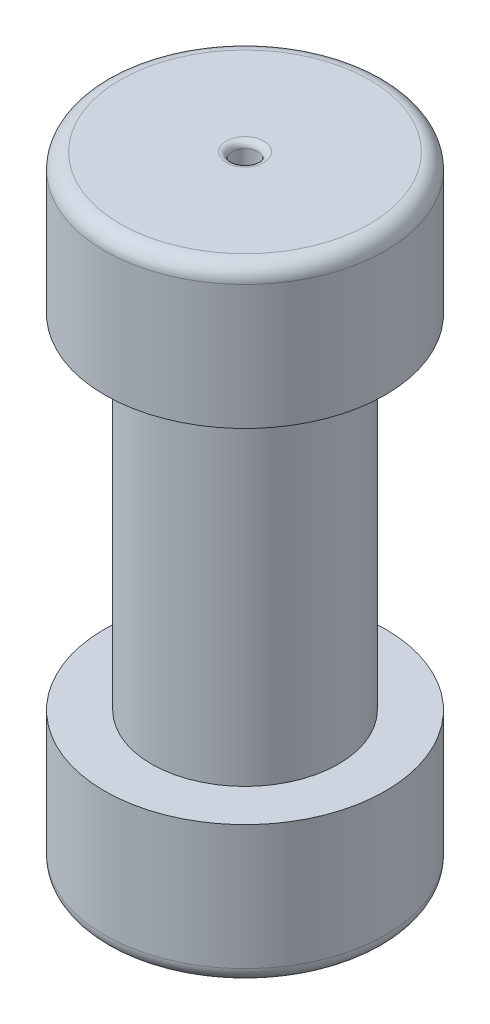
ISO-10303-21;
HEADER;
FILE_DESCRIPTION(('STEP AP214'),'2;1');
FILE_NAME('part.step','',(''),(''),'','','');
FILE_SCHEMA(('AUTOMOTIVE_DESIGN { 1 0 10303 214 1 1 1 1 }'));
ENDSEC;
DATA;
#1=APPLICATION_CONTEXT('core data for automotive mechanical design processes');
#2=APPLICATION_PROTOCOL_DEFINITION('international standard','automotive_design',2000,#1);
#3=PRODUCT_CONTEXT('',#1,'mechanical');
#4=PRODUCT('Part','Part','',(#3));
#5=PRODUCT_RELATED_PRODUCT_CATEGORY('part','',(#4));
#6=PRODUCT_DEFINITION_FORMATION('','',#4);
#7=PRODUCT_DEFINITION_CONTEXT('part definition',#1,'design');
#8=PRODUCT_DEFINITION('design','',#6,#7);
#9=PRODUCT_DEFINITION_SHAPE('','',#8);
#10=(LENGTH_UNIT() NAMED_UNIT(*) SI_UNIT(.MILLI.,.METRE.));
#11=(NAMED_UNIT(*) PLANE_ANGLE_UNIT() SI_UNIT($,.RADIAN.));
#12=(NAMED_UNIT(*) SI_UNIT($,.STERADIAN.) SOLID_ANGLE_UNIT());
#13=UNCERTAINTY_MEASURE_WITH_UNIT(LENGTH_MEASURE(1.E-05),#10,'distance_accuracy_value','');
#14=(GEOMETRIC_REPRESENTATION_CONTEXT(3) GLOBAL_UNCERTAINTY_ASSIGNED_CONTEXT((#13)) GLOBAL_UNIT_ASSIGNED_CONTEXT((#10,
#11,#12)) REPRESENTATION_CONTEXT('',''));
#15=CARTESIAN_POINT('',(0.,0.,0.));
#16=DIRECTION('',(0.,0.,1.));
#17=DIRECTION('',(1.,0.,0.));
#18=AXIS2_PLACEMENT_3D('',#15,#16,#17);
#19=CARTESIAN_POINT('',(0.,22.86,0.));
#20=DIRECTION('',(0.,-1.,0.));
#21=DIRECTION('',(0.,0.,-1.));
#22=AXIS2_PLACEMENT_3D('',#19,#20,#21);
#23=CYLINDRICAL_SURFACE('',#22,22.86);
#24=CARTESIAN_POINT('',(0.,2.54,0.));
#25=DIRECTION('',(0.,1.,0.));
#26=DIRECTION('',(0.,0.,1.));
#27=AXIS2_PLACEMENT_3D('',#24,#25,#26);
#28=CIRCLE('',#27,22.86);
#29=CARTESIAN_POINT('',(0.,2.54,22.86));
#30=VERTEX_POINT('',#29);
#31=EDGE_CURVE('E144',#30,#30,#28,.T.);
#32=ORIENTED_EDGE('',*,*,#31,.T.);
#33=EDGE_LOOP('',(#32));
#34=FACE_BOUND('',#33,.T.);
#35=CARTESIAN_POINT('',(0.,22.86,0.));
#36=DIRECTION('',(0.,1.,0.));
#37=DIRECTION('',(0.,0.,1.));
#38=AXIS2_PLACEMENT_3D('',#35,#36,#37);
#39=CIRCLE('',#38,22.86);
#40=CARTESIAN_POINT('',(0.,22.86,22.86));
#41=VERTEX_POINT('',#40);
#42=EDGE_CURVE('E140',#41,#41,#39,.T.);
#43=ORIENTED_EDGE('',*,*,#42,.F.);
#44=EDGE_LOOP('',(#43));
#45=FACE_BOUND('',#44,.T.);
#46=ADVANCED_FACE('F42',(#34,#45),#23,.T.);
#47=CARTESIAN_POINT('',(0.,22.86,0.));
#48=DIRECTION('',(0.,1.,0.));
#49=DIRECTION('',(0.,0.,1.));
#50=AXIS2_PLACEMENT_3D('',#47,#48,#49);
#51=PLANE('',#50);
#52=CARTESIAN_POINT('',(0.,22.86,0.));
#53=DIRECTION('',(0.,1.,0.));
#54=DIRECTION('',(0.,0.,1.));
#55=AXIS2_PLACEMENT_3D('',#52,#53,#54);
#56=CIRCLE('',#55,15.24);
#57=CARTESIAN_POINT('',(0.,22.86,15.24));
#58=VERTEX_POINT('',#57);
#59=EDGE_CURVE('E141',#58,#58,#56,.T.);
#60=ORIENTED_EDGE('',*,*,#59,.F.);
#61=EDGE_LOOP('',(#60));
#62=FACE_BOUND('',#61,.T.);
#63=ORIENTED_EDGE('',*,*,#42,.T.);
#64=EDGE_LOOP('',(#63));
#65=FACE_BOUND('',#64,.T.);
#66=ADVANCED_FACE('F204',(#62,#65),#51,.T.);
#67=CARTESIAN_POINT('',(0.,0.,0.));
#68=DIRECTION('',(0.,1.,0.));
#69=DIRECTION('',(0.,0.,1.));
#70=AXIS2_PLACEMENT_3D('',#67,#68,#69);
#71=PLANE('',#70);
#72=DIRECTION('',(1.,0.,0.));
#73=VECTOR('',#72,1.);
#74=CARTESIAN_POINT('',(0.,0.,-2.7));
#75=LINE('',#74,#73);
#76=CARTESIAN_POINT('',(2.85,0.,-2.7));
#77=VERTEX_POINT('',#76);
#78=CARTESIAN_POINT('',(-2.85,0.,-2.7));
#79=VERTEX_POINT('',#78);
#80=EDGE_CURVE('E163',#77,#79,#75,.F.);
#81=ORIENTED_EDGE('',*,*,#80,.T.);
#82=DIRECTION('',(0.,0.,-1.));
#83=VECTOR('',#82,1.);
#84=CARTESIAN_POINT('',(-2.85,0.,0.));
#85=LINE('',#84,#83);
#86=CARTESIAN_POINT('',(-2.85,0.,2.7));
#87=VERTEX_POINT('',#86);
#88=EDGE_CURVE('E165',#79,#87,#85,.F.);
#89=ORIENTED_EDGE('',*,*,#88,.T.);
#90=DIRECTION('',(-1.,0.,0.));
#91=VECTOR('',#90,1.);
#92=CARTESIAN_POINT('',(0.,0.,2.7));
#93=LINE('',#92,#91);
#94=CARTESIAN_POINT('',(2.85,0.,2.7));
#95=VERTEX_POINT('',#94);
#96=EDGE_CURVE('E159',#87,#95,#93,.F.);
#97=ORIENTED_EDGE('',*,*,#96,.T.);
#98=DIRECTION('',(0.,0.,1.));
#99=VECTOR('',#98,1.);
#100=CARTESIAN_POINT('',(2.85,0.,0.));
#101=LINE('',#100,#99);
#102=EDGE_CURVE('E161',#95,#77,#101,.F.);
#103=ORIENTED_EDGE('',*,*,#102,.T.);
#104=EDGE_LOOP('',(#81,#89,#97,#103));
#105=FACE_BOUND('',#104,.T.);
#106=CARTESIAN_POINT('',(0.,0.,0.));
#107=DIRECTION('',(0.,1.,0.));
#108=DIRECTION('',(0.,0.,1.));
#109=AXIS2_PLACEMENT_3D('',#106,#107,#108);
#110=CIRCLE('',#109,20.32);
#111=CARTESIAN_POINT('',(0.,0.,20.32));
#112=VERTEX_POINT('',#111);
#113=EDGE_CURVE('E149',#112,#112,#110,.F.);
#114=ORIENTED_EDGE('',*,*,#113,.T.);
#115=EDGE_LOOP('',(#114));
#116=FACE_BOUND('',#115,.T.);
#117=ADVANCED_FACE('F212',(#105,#116),#71,.F.);
#118=CARTESIAN_POINT('',(0.,78.74,0.));
#119=DIRECTION('',(0.,-1.,0.));
#120=DIRECTION('',(0.,0.,-1.));
#121=AXIS2_PLACEMENT_3D('',#118,#119,#120);
#122=CYLINDRICAL_SURFACE('',#121,15.24);
#123=CARTESIAN_POINT('',(0.,78.74,0.));
#124=DIRECTION('',(0.,1.,0.));
#125=DIRECTION('',(0.,0.,1.));
#126=AXIS2_PLACEMENT_3D('',#123,#124,#125);
#127=CIRCLE('',#126,15.24);
#128=CARTESIAN_POINT('',(0.,78.74,15.24));
#129=VERTEX_POINT('',#128);
#130=EDGE_CURVE('E137',#129,#129,#127,.T.);
#131=ORIENTED_EDGE('',*,*,#130,.F.);
#132=EDGE_LOOP('',(#131));
#133=FACE_BOUND('',#132,.T.);
#134=ORIENTED_EDGE('',*,*,#59,.T.);
#135=EDGE_LOOP('',(#134));
#136=FACE_BOUND('',#135,.T.);
#137=ADVANCED_FACE('F254',(#133,#136),#122,.T.);
#138=CARTESIAN_POINT('',(0.,101.6,0.));
#139=DIRECTION('',(0.,-1.,0.));
#140=DIRECTION('',(0.,0.,-1.));
#141=AXIS2_PLACEMENT_3D('',#138,#139,#140);
#142=CYLINDRICAL_SURFACE('',#141,22.86);
#143=CARTESIAN_POINT('',(0.,99.06,0.));
#144=DIRECTION('',(0.,1.,0.));
#145=DIRECTION('',(0.,0.,1.));
#146=AXIS2_PLACEMENT_3D('',#143,#144,#145);
#147=CIRCLE('',#146,22.86);
#148=CARTESIAN_POINT('',(0.,99.06,22.86));
#149=VERTEX_POINT('',#148);
#150=EDGE_CURVE('E155',#149,#149,#147,.F.);
#151=ORIENTED_EDGE('',*,*,#150,.T.);
#152=EDGE_LOOP('',(#151));
#153=FACE_BOUND('',#152,.T.);
#154=CARTESIAN_POINT('',(0.,78.74,0.));
#155=DIRECTION('',(0.,1.,0.));
#156=DIRECTION('',(0.,0.,1.));
#157=AXIS2_PLACEMENT_3D('',#154,#155,#156);
#158=CIRCLE('',#157,22.86);
#159=CARTESIAN_POINT('',(0.,78.74,22.86));
#160=VERTEX_POINT('',#159);
#161=EDGE_CURVE('E134',#160,#160,#158,.T.);
#162=ORIENTED_EDGE('',*,*,#161,.T.);
#163=EDGE_LOOP('',(#162));
#164=FACE_BOUND('',#163,.T.);
#165=ADVANCED_FACE('F265',(#153,#164),#142,.T.);
#166=CARTESIAN_POINT('',(0.,101.6,0.));
#167=DIRECTION('',(0.,1.,0.));
#168=DIRECTION('',(0.,0.,1.));
#169=AXIS2_PLACEMENT_3D('',#166,#167,#168);
#170=PLANE('',#169);
#171=CARTESIAN_POINT('',(0.,101.6,0.));
#172=DIRECTION('',(0.,1.,0.));
#173=DIRECTION('',(0.,0.,1.));
#174=AXIS2_PLACEMENT_3D('',#171,#172,#173);
#175=CIRCLE('',#174,3.055);
#176=CARTESIAN_POINT('',(0.,101.6,3.055));
#177=VERTEX_POINT('',#176);
#178=EDGE_CURVE('E11',#177,#177,#175,.F.);
#179=ORIENTED_EDGE('',*,*,#178,.T.);
#180=EDGE_LOOP('',(#179));
#181=FACE_BOUND('',#180,.T.);
#182=CARTESIAN_POINT('',(0.,101.6,0.));
#183=DIRECTION('',(0.,1.,0.));
#184=DIRECTION('',(0.,0.,1.));
#185=AXIS2_PLACEMENT_3D('',#182,#183,#184);
#186=CIRCLE('',#185,20.32);
#187=CARTESIAN_POINT('',(0.,101.6,20.32));
#188=VERTEX_POINT('',#187);
#189=EDGE_CURVE('E152',#188,#188,#186,.T.);
#190=ORIENTED_EDGE('',*,*,#189,.T.);
#191=EDGE_LOOP('',(#190));
#192=FACE_BOUND('',#191,.T.);
#193=ADVANCED_FACE('F261',(#181,#192),#170,.T.);
#194=CARTESIAN_POINT('',(0.,78.74,0.));
#195=DIRECTION('',(0.,1.,0.));
#196=DIRECTION('',(0.,0.,1.));
#197=AXIS2_PLACEMENT_3D('',#194,#195,#196);
#198=PLANE('',#197);
#199=ORIENTED_EDGE('',*,*,#130,.T.);
#200=EDGE_LOOP('',(#199));
#201=FACE_BOUND('',#200,.T.);
#202=ORIENTED_EDGE('',*,*,#161,.F.);
#203=EDGE_LOOP('',(#202));
#204=FACE_BOUND('',#203,.T.);
#205=ADVANCED_FACE('F222',(#201,#204),#198,.F.);
#206=CARTESIAN_POINT('',(0.,2.54,0.));
#207=DIRECTION('',(0.,1.,0.));
#208=DIRECTION('',(0.,0.,1.));
#209=AXIS2_PLACEMENT_3D('',#206,#207,#208);
#210=TOROIDAL_SURFACE('',#209,20.32,2.54);
#211=ORIENTED_EDGE('',*,*,#113,.F.);
#212=EDGE_LOOP('',(#211));
#213=FACE_BOUND('',#212,.T.);
#214=ORIENTED_EDGE('',*,*,#31,.F.);
#215=EDGE_LOOP('',(#214));
#216=FACE_BOUND('',#215,.T.);
#217=ADVANCED_FACE('F218',(#213,#216),#210,.T.);
#218=CARTESIAN_POINT('',(0.,99.06,0.));
#219=DIRECTION('',(0.,1.,0.));
#220=DIRECTION('',(0.,0.,1.));
#221=AXIS2_PLACEMENT_3D('',#218,#219,#220);
#222=TOROIDAL_SURFACE('',#221,20.32,2.54);
#223=ORIENTED_EDGE('',*,*,#150,.F.);
#224=EDGE_LOOP('',(#223));
#225=FACE_BOUND('',#224,.T.);
#226=ORIENTED_EDGE('',*,*,#189,.F.);
#227=EDGE_LOOP('',(#226));
#228=FACE_BOUND('',#227,.T.);
#229=ADVANCED_FACE('F221',(#225,#228),#222,.T.);
#230=CARTESIAN_POINT('',(0.,93.98,0.));
#231=DIRECTION('',(0.,1.,0.));
#232=DIRECTION('',(0.,0.,1.));
#233=AXIS2_PLACEMENT_3D('',#230,#231,#232);
#234=CYLINDRICAL_SURFACE('',#233,2.055);
#235=CARTESIAN_POINT('',(0.,100.6,0.));
#236=DIRECTION('',(0.,1.,0.));
#237=DIRECTION('',(0.,0.,1.));
#238=AXIS2_PLACEMENT_3D('',#235,#236,#237);
#239=CIRCLE('',#238,2.055);
#240=CARTESIAN_POINT('',(0.,100.6,2.055));
#241=VERTEX_POINT('',#240);
#242=EDGE_CURVE('E51',#241,#241,#239,.T.);
#243=ORIENTED_EDGE('',*,*,#242,.T.);
#244=EDGE_LOOP('',(#243));
#245=FACE_BOUND('',#244,.T.);
#246=CARTESIAN_POINT('',(0.,93.98,0.));
#247=DIRECTION('',(0.,1.,0.));
#248=DIRECTION('',(0.,0.,1.));
#249=AXIS2_PLACEMENT_3D('',#246,#247,#248);
#250=CIRCLE('',#249,2.055);
#251=CARTESIAN_POINT('',(0.,93.98,2.055));
#252=VERTEX_POINT('',#251);
#253=EDGE_CURVE('E128',#252,#252,#250,.T.);
#254=ORIENTED_EDGE('',*,*,#253,.F.);
#255=EDGE_LOOP('',(#254));
#256=FACE_BOUND('',#255,.T.);
#257=ADVANCED_FACE('F226',(#245,#256),#234,.F.);
#258=CARTESIAN_POINT('',(0.,93.98,0.));
#259=DIRECTION('',(0.,1.,0.));
#260=DIRECTION('',(0.,0.,1.));
#261=AXIS2_PLACEMENT_3D('',#258,#259,#260);
#262=PLANE('',#261);
#263=ORIENTED_EDGE('',*,*,#253,.T.);
#264=EDGE_LOOP('',(#263));
#265=FACE_BOUND('',#264,.T.);
#266=ADVANCED_FACE('F248',(#265),#262,.T.);
#267=CARTESIAN_POINT('',(-1.85,85.,1.7));
#268=DIRECTION('',(-1.,0.,0.));
#269=DIRECTION('',(0.,0.,1.));
#270=AXIS2_PLACEMENT_3D('',#267,#268,#269);
#271=PLANE('',#270);
#272=DIRECTION('',(0.,-1.,0.));
#273=VECTOR('',#272,1.);
#274=CARTESIAN_POINT('',(-1.85,85.,1.7));
#275=LINE('',#274,#273);
#276=CARTESIAN_POINT('',(-1.85,85.,1.7));
#277=VERTEX_POINT('',#276);
#278=CARTESIAN_POINT('',(-1.85,1.,1.7));
#279=VERTEX_POINT('',#278);
#280=EDGE_CURVE('E126',#277,#279,#275,.T.);
#281=ORIENTED_EDGE('',*,*,#280,.T.);
#282=DIRECTION('',(0.,0.,-1.));
#283=VECTOR('',#282,1.);
#284=CARTESIAN_POINT('',(-1.85,1.,1.7));
#285=LINE('',#284,#283);
#286=CARTESIAN_POINT('',(-1.85,1.,-1.7));
#287=VERTEX_POINT('',#286);
#288=EDGE_CURVE('E106',#279,#287,#285,.T.);
#289=ORIENTED_EDGE('',*,*,#288,.T.);
#290=DIRECTION('',(0.,-1.,0.));
#291=VECTOR('',#290,1.);
#292=CARTESIAN_POINT('',(-1.85,85.,-1.7));
#293=LINE('',#292,#291);
#294=CARTESIAN_POINT('',(-1.85,85.,-1.7));
#295=VERTEX_POINT('',#294);
#296=EDGE_CURVE('E98',#295,#287,#293,.T.);
#297=ORIENTED_EDGE('',*,*,#296,.F.);
#298=DIRECTION('',(0.,0.,-1.));
#299=VECTOR('',#298,1.);
#300=CARTESIAN_POINT('',(-1.85,85.,1.7));
#301=LINE('',#300,#299);
#302=EDGE_CURVE('E103',#277,#295,#301,.T.);
#303=ORIENTED_EDGE('',*,*,#302,.F.);
#304=EDGE_LOOP('',(#281,#289,#297,#303));
#305=FACE_BOUND('',#304,.T.);
#306=ADVANCED_FACE('F101',(#305),#271,.F.);
#307=CARTESIAN_POINT('',(-1.85,85.,1.7));
#308=DIRECTION('',(0.,0.,1.));
#309=DIRECTION('',(1.,0.,0.));
#310=AXIS2_PLACEMENT_3D('',#307,#308,#309);
#311=PLANE('',#310);
#312=DIRECTION('',(0.,-1.,0.));
#313=VECTOR('',#312,1.);
#314=CARTESIAN_POINT('',(1.85,85.,1.7));
#315=LINE('',#314,#313);
#316=CARTESIAN_POINT('',(1.85,85.,1.7));
#317=VERTEX_POINT('',#316);
#318=CARTESIAN_POINT('',(1.85,1.,1.7));
#319=VERTEX_POINT('',#318);
#320=EDGE_CURVE('E129',#317,#319,#315,.T.);
#321=ORIENTED_EDGE('',*,*,#320,.T.);
#322=DIRECTION('',(-1.,0.,0.));
#323=VECTOR('',#322,1.);
#324=CARTESIAN_POINT('',(-1.85,1.,1.7));
#325=LINE('',#324,#323);
#326=EDGE_CURVE('E170',#319,#279,#325,.T.);
#327=ORIENTED_EDGE('',*,*,#326,.T.);
#328=ORIENTED_EDGE('',*,*,#280,.F.);
#329=DIRECTION('',(-1.,0.,0.));
#330=VECTOR('',#329,1.);
#331=CARTESIAN_POINT('',(-1.85,85.,1.7));
#332=LINE('',#331,#330);
#333=EDGE_CURVE('E108',#317,#277,#332,.T.);
#334=ORIENTED_EDGE('',*,*,#333,.F.);
#335=EDGE_LOOP('',(#321,#327,#328,#334));
#336=FACE_BOUND('',#335,.T.);
#337=ADVANCED_FACE('F193',(#336),#311,.F.);
#338=CARTESIAN_POINT('',(1.85,85.,1.7));
#339=DIRECTION('',(1.,0.,0.));
#340=DIRECTION('',(0.,0.,-1.));
#341=AXIS2_PLACEMENT_3D('',#338,#339,#340);
#342=PLANE('',#341);
#343=DIRECTION('',(0.,-1.,0.));
#344=VECTOR('',#343,1.);
#345=CARTESIAN_POINT('',(1.85,85.,-1.7));
#346=LINE('',#345,#344);
#347=CARTESIAN_POINT('',(1.85,85.,-1.7));
#348=VERTEX_POINT('',#347);
#349=CARTESIAN_POINT('',(1.85,1.,-1.7));
#350=VERTEX_POINT('',#349);
#351=EDGE_CURVE('E107',#348,#350,#346,.T.);
#352=ORIENTED_EDGE('',*,*,#351,.T.);
#353=DIRECTION('',(0.,0.,1.));
#354=VECTOR('',#353,1.);
#355=CARTESIAN_POINT('',(1.85,1.,1.7));
#356=LINE('',#355,#354);
#357=EDGE_CURVE('E59',#350,#319,#356,.T.);
#358=ORIENTED_EDGE('',*,*,#357,.T.);
#359=ORIENTED_EDGE('',*,*,#320,.F.);
#360=DIRECTION('',(0.,0.,1.));
#361=VECTOR('',#360,1.);
#362=CARTESIAN_POINT('',(1.85,85.,1.7));
#363=LINE('',#362,#361);
#364=EDGE_CURVE('E116',#348,#317,#363,.T.);
#365=ORIENTED_EDGE('',*,*,#364,.F.);
#366=EDGE_LOOP('',(#352,#358,#359,#365));
#367=FACE_BOUND('',#366,.T.);
#368=ADVANCED_FACE('F194',(#367),#342,.F.);
#369=CARTESIAN_POINT('',(-1.85,85.,-1.7));
#370=DIRECTION('',(0.,0.,-1.));
#371=DIRECTION('',(-1.,0.,0.));
#372=AXIS2_PLACEMENT_3D('',#369,#370,#371);
#373=PLANE('',#372);
#374=ORIENTED_EDGE('',*,*,#296,.T.);
#375=DIRECTION('',(1.,0.,0.));
#376=VECTOR('',#375,1.);
#377=CARTESIAN_POINT('',(-1.85,1.,-1.7));
#378=LINE('',#377,#376);
#379=EDGE_CURVE('E67',#287,#350,#378,.T.);
#380=ORIENTED_EDGE('',*,*,#379,.T.);
#381=ORIENTED_EDGE('',*,*,#351,.F.);
#382=DIRECTION('',(1.,0.,0.));
#383=VECTOR('',#382,1.);
#384=CARTESIAN_POINT('',(-1.85,85.,-1.7));
#385=LINE('',#384,#383);
#386=EDGE_CURVE('E111',#295,#348,#385,.T.);
#387=ORIENTED_EDGE('',*,*,#386,.F.);
#388=EDGE_LOOP('',(#374,#380,#381,#387));
#389=FACE_BOUND('',#388,.T.);
#390=ADVANCED_FACE('F112',(#389),#373,.F.);
#391=CARTESIAN_POINT('',(0.,85.,0.));
#392=DIRECTION('',(0.,-1.,0.));
#393=DIRECTION('',(0.,0.,-1.));
#394=AXIS2_PLACEMENT_3D('',#391,#392,#393);
#395=PLANE('',#394);
#396=ORIENTED_EDGE('',*,*,#302,.T.);
#397=ORIENTED_EDGE('',*,*,#386,.T.);
#398=ORIENTED_EDGE('',*,*,#364,.T.);
#399=ORIENTED_EDGE('',*,*,#333,.T.);
#400=EDGE_LOOP('',(#396,#397,#398,#399));
#401=FACE_BOUND('',#400,.T.);
#402=ADVANCED_FACE('F118',(#401),#395,.T.);
#403=CARTESIAN_POINT('',(2.85,1.,1.7));
#404=DIRECTION('',(0.,0.,1.));
#405=DIRECTION('',(1.,0.,0.));
#406=AXIS2_PLACEMENT_3D('',#403,#404,#405);
#407=CYLINDRICAL_SURFACE('',#406,1.);
#408=CARTESIAN_POINT('',(2.85,1.,-2.7));
#409=DIRECTION('',(0.707106781186547,0.,0.707106781186548));
#410=DIRECTION('',(0.707106781186548,0.,-0.707106781186547));
#411=AXIS2_PLACEMENT_3D('',#408,#409,#410);
#412=ELLIPSE('',#411,1.4142135623731,1.);
#413=EDGE_CURVE('E122',#77,#350,#412,.F.);
#414=ORIENTED_EDGE('',*,*,#413,.F.);
#415=ORIENTED_EDGE('',*,*,#102,.F.);
#416=CARTESIAN_POINT('',(2.85,1.,2.7));
#417=DIRECTION('',(-0.707106781186548,0.,0.707106781186547));
#418=DIRECTION('',(0.707106781186547,0.,0.707106781186548));
#419=AXIS2_PLACEMENT_3D('',#416,#417,#418);
#420=ELLIPSE('',#419,1.41421356237309,1.);
#421=EDGE_CURVE('E46',#319,#95,#420,.T.);
#422=ORIENTED_EDGE('',*,*,#421,.F.);
#423=ORIENTED_EDGE('',*,*,#357,.F.);
#424=EDGE_LOOP('',(#414,#415,#422,#423));
#425=FACE_BOUND('',#424,.T.);
#426=ADVANCED_FACE('F185',(#425),#407,.T.);
#427=CARTESIAN_POINT('',(-1.85,1.,2.7));
#428=DIRECTION('',(-1.,0.,0.));
#429=DIRECTION('',(0.,0.,1.));
#430=AXIS2_PLACEMENT_3D('',#427,#428,#429);
#431=CYLINDRICAL_SURFACE('',#430,1.);
#432=ORIENTED_EDGE('',*,*,#421,.T.);
#433=ORIENTED_EDGE('',*,*,#96,.F.);
#434=CARTESIAN_POINT('',(-2.85,1.,2.7));
#435=DIRECTION('',(-0.707106781186547,0.,-0.707106781186548));
#436=DIRECTION('',(0.707106781186548,0.,-0.707106781186547));
#437=AXIS2_PLACEMENT_3D('',#434,#435,#436);
#438=ELLIPSE('',#437,1.41421356237309,1.);
#439=EDGE_CURVE('E176',#279,#87,#438,.T.);
#440=ORIENTED_EDGE('',*,*,#439,.F.);
#441=ORIENTED_EDGE('',*,*,#326,.F.);
#442=EDGE_LOOP('',(#432,#433,#440,#441));
#443=FACE_BOUND('',#442,.T.);
#444=ADVANCED_FACE('F191',(#443),#431,.T.);
#445=CARTESIAN_POINT('',(-1.85,1.,-2.7));
#446=DIRECTION('',(1.,0.,0.));
#447=DIRECTION('',(0.,0.,-1.));
#448=AXIS2_PLACEMENT_3D('',#445,#446,#447);
#449=CYLINDRICAL_SURFACE('',#448,1.);
#450=ORIENTED_EDGE('',*,*,#413,.T.);
#451=ORIENTED_EDGE('',*,*,#379,.F.);
#452=CARTESIAN_POINT('',(-2.85,1.,-2.7));
#453=DIRECTION('',(0.707106781186548,0.,-0.707106781186547));
#454=DIRECTION('',(-0.707106781186547,0.,-0.707106781186548));
#455=AXIS2_PLACEMENT_3D('',#452,#453,#454);
#456=ELLIPSE('',#455,1.4142135623731,1.);
#457=EDGE_CURVE('E174',#79,#287,#456,.F.);
#458=ORIENTED_EDGE('',*,*,#457,.F.);
#459=ORIENTED_EDGE('',*,*,#80,.F.);
#460=EDGE_LOOP('',(#450,#451,#458,#459));
#461=FACE_BOUND('',#460,.T.);
#462=ADVANCED_FACE('F181',(#461),#449,.T.);
#463=CARTESIAN_POINT('',(-2.85,1.,1.7));
#464=DIRECTION('',(0.,0.,-1.));
#465=DIRECTION('',(-1.,0.,0.));
#466=AXIS2_PLACEMENT_3D('',#463,#464,#465);
#467=CYLINDRICAL_SURFACE('',#466,1.);
#468=ORIENTED_EDGE('',*,*,#439,.T.);
#469=ORIENTED_EDGE('',*,*,#88,.F.);
#470=ORIENTED_EDGE('',*,*,#457,.T.);
#471=ORIENTED_EDGE('',*,*,#288,.F.);
#472=EDGE_LOOP('',(#468,#469,#470,#471));
#473=FACE_BOUND('',#472,.T.);
#474=ADVANCED_FACE('F228',(#473),#467,.T.);
#475=CARTESIAN_POINT('',(0.,100.6,0.));
#476=DIRECTION('',(0.,1.,0.));
#477=DIRECTION('',(0.,0.,1.));
#478=AXIS2_PLACEMENT_3D('',#475,#476,#477);
#479=TOROIDAL_SURFACE('',#478,3.055,1.);
#480=ORIENTED_EDGE('',*,*,#178,.F.);
#481=EDGE_LOOP('',(#480));
#482=FACE_BOUND('',#481,.T.);
#483=ORIENTED_EDGE('',*,*,#242,.F.);
#484=EDGE_LOOP('',(#483));
#485=FACE_BOUND('',#484,.T.);
#486=ADVANCED_FACE('F44',(#482,#485),#479,.T.);
#487=CLOSED_SHELL('',(#46,#66,#117,#137,#165,#193,#205,#217,#229,#257,#266,#306,#337,#368,#390,
#402,#426,#444,#462,#474,#486));
#488=MANIFOLD_SOLID_BREP('B2',#487);
#489=ADVANCED_BREP_SHAPE_REPRESENTATION('',(#18,#488),#14);
#490=SHAPE_DEFINITION_REPRESENTATION(#9,#489);
ENDSEC;
END-ISO-10303-21;
